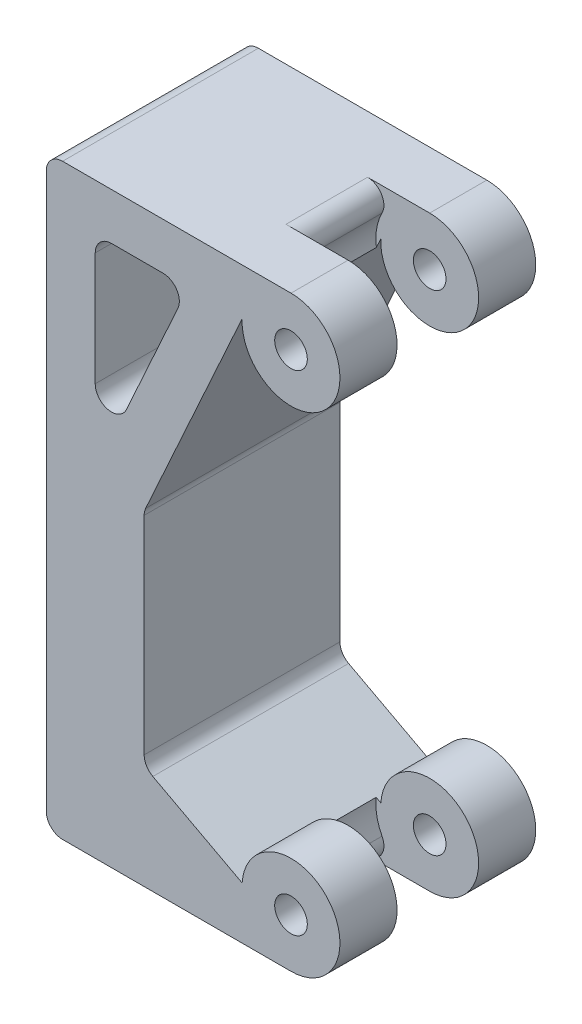
ISO-10303-21;
HEADER;
FILE_DESCRIPTION(('STEP AP214'),'2;1');
FILE_NAME('part.step','',(''),(''),'','','');
FILE_SCHEMA(('AUTOMOTIVE_DESIGN { 1 0 10303 214 1 1 1 1 }'));
ENDSEC;
DATA;
#1=APPLICATION_CONTEXT('core data for automotive mechanical design processes');
#2=APPLICATION_PROTOCOL_DEFINITION('international standard','automotive_design',2000,#1);
#3=PRODUCT_CONTEXT('',#1,'mechanical');
#4=PRODUCT('Part','Part','',(#3));
#5=PRODUCT_RELATED_PRODUCT_CATEGORY('part','',(#4));
#6=PRODUCT_DEFINITION_FORMATION('','',#4);
#7=PRODUCT_DEFINITION_CONTEXT('part definition',#1,'design');
#8=PRODUCT_DEFINITION('design','',#6,#7);
#9=PRODUCT_DEFINITION_SHAPE('','',#8);
#10=(LENGTH_UNIT() NAMED_UNIT(*) SI_UNIT(.MILLI.,.METRE.));
#11=(NAMED_UNIT(*) PLANE_ANGLE_UNIT() SI_UNIT($,.RADIAN.));
#12=(NAMED_UNIT(*) SI_UNIT($,.STERADIAN.) SOLID_ANGLE_UNIT());
#13=UNCERTAINTY_MEASURE_WITH_UNIT(LENGTH_MEASURE(1.E-05),#10,'distance_accuracy_value','');
#14=(GEOMETRIC_REPRESENTATION_CONTEXT(3) GLOBAL_UNCERTAINTY_ASSIGNED_CONTEXT((#13)) GLOBAL_UNIT_ASSIGNED_CONTEXT((#10,
#11,#12)) REPRESENTATION_CONTEXT('',''));
#15=CARTESIAN_POINT('',(0.,0.,0.));
#16=DIRECTION('',(0.,0.,1.));
#17=DIRECTION('',(1.,0.,0.));
#18=AXIS2_PLACEMENT_3D('',#15,#16,#17);
#19=CARTESIAN_POINT('',(15.,3.,12.));
#20=DIRECTION('',(0.,0.,-1.));
#21=DIRECTION('',(-1.,0.,0.));
#22=AXIS2_PLACEMENT_3D('',#19,#20,#21);
#23=CYLINDRICAL_SURFACE('',#22,3.);
#24=CARTESIAN_POINT('',(15.,3.,3.5));
#25=DIRECTION('',(0.,0.,1.));
#26=DIRECTION('',(1.,0.,0.));
#27=AXIS2_PLACEMENT_3D('',#24,#25,#26);
#28=CIRCLE('',#27,3.);
#29=CARTESIAN_POINT('',(15.,0.,3.5));
#30=VERTEX_POINT('',#29);
#31=CARTESIAN_POINT('',(12.0063708285754,3.19540824955942,3.5));
#32=VERTEX_POINT('',#31);
#33=EDGE_CURVE('E224',#30,#32,#28,.T.);
#34=ORIENTED_EDGE('',*,*,#33,.F.);
#35=DIRECTION('',(0.,0.,-1.));
#36=VECTOR('',#35,1.);
#37=CARTESIAN_POINT('',(15.,0.,12.));
#38=LINE('',#37,#36);
#39=CARTESIAN_POINT('',(15.,0.,0.));
#40=VERTEX_POINT('',#39);
#41=EDGE_CURVE('E252',#30,#40,#38,.T.);
#42=ORIENTED_EDGE('',*,*,#41,.T.);
#43=CARTESIAN_POINT('',(15.,3.,0.));
#44=DIRECTION('',(0.,0.,1.));
#45=DIRECTION('',(1.,0.,0.));
#46=AXIS2_PLACEMENT_3D('',#43,#44,#45);
#47=CIRCLE('',#46,3.);
#48=CARTESIAN_POINT('',(12.0063708285754,3.19540824955942,0.));
#49=VERTEX_POINT('',#48);
#50=EDGE_CURVE('E389',#40,#49,#47,.T.);
#51=ORIENTED_EDGE('',*,*,#50,.T.);
#52=DIRECTION('',(0.,0.,-1.));
#53=VECTOR('',#52,1.);
#54=CARTESIAN_POINT('',(12.0063708285754,3.19540824955942,12.));
#55=LINE('',#54,#53);
#56=EDGE_CURVE('E411',#32,#49,#55,.T.);
#57=ORIENTED_EDGE('',*,*,#56,.F.);
#58=EDGE_LOOP('',(#34,#42,#51,#57));
#59=FACE_BOUND('',#58,.T.);
#60=ADVANCED_FACE('F33',(#59),#23,.T.);
#61=CARTESIAN_POINT('',(15.,33.,12.));
#62=DIRECTION('',(0.,0.,-1.));
#63=DIRECTION('',(-1.,0.,0.));
#64=AXIS2_PLACEMENT_3D('',#61,#62,#63);
#65=CYLINDRICAL_SURFACE('',#64,3.);
#66=CARTESIAN_POINT('',(15.,33.,3.5));
#67=DIRECTION('',(0.,0.,1.));
#68=DIRECTION('',(1.,0.,0.));
#69=AXIS2_PLACEMENT_3D('',#66,#67,#68);
#70=CIRCLE('',#69,3.);
#71=CARTESIAN_POINT('',(12.003141676768,33.1372595733469,3.5));
#72=VERTEX_POINT('',#71);
#73=CARTESIAN_POINT('',(15.,36.,3.5));
#74=VERTEX_POINT('',#73);
#75=EDGE_CURVE('E426',#72,#74,#70,.T.);
#76=ORIENTED_EDGE('',*,*,#75,.F.);
#77=DIRECTION('',(0.,0.,-1.));
#78=VECTOR('',#77,1.);
#79=CARTESIAN_POINT('',(12.003141676768,33.1372595733469,12.));
#80=LINE('',#79,#78);
#81=CARTESIAN_POINT('',(12.003141676768,33.1372595733469,0.));
#82=VERTEX_POINT('',#81);
#83=EDGE_CURVE('E407',#72,#82,#80,.T.);
#84=ORIENTED_EDGE('',*,*,#83,.T.);
#85=CARTESIAN_POINT('',(15.,33.,0.));
#86=DIRECTION('',(0.,0.,1.));
#87=DIRECTION('',(-1.,0.,0.));
#88=AXIS2_PLACEMENT_3D('',#85,#86,#87);
#89=CIRCLE('',#88,3.);
#90=CARTESIAN_POINT('',(15.,36.,0.));
#91=VERTEX_POINT('',#90);
#92=EDGE_CURVE('E399',#82,#91,#89,.T.);
#93=ORIENTED_EDGE('',*,*,#92,.T.);
#94=DIRECTION('',(0.,0.,-1.));
#95=VECTOR('',#94,1.);
#96=CARTESIAN_POINT('',(15.,36.,12.));
#97=LINE('',#96,#95);
#98=EDGE_CURVE('E384',#74,#91,#97,.T.);
#99=ORIENTED_EDGE('',*,*,#98,.F.);
#100=EDGE_LOOP('',(#76,#84,#93,#99));
#101=FACE_BOUND('',#100,.T.);
#102=ADVANCED_FACE('F467',(#101),#65,.T.);
#103=CARTESIAN_POINT('',(15.,33.,12.));
#104=DIRECTION('',(0.,0.,-1.));
#105=DIRECTION('',(-1.,0.,0.));
#106=AXIS2_PLACEMENT_3D('',#103,#104,#105);
#107=CYLINDRICAL_SURFACE('',#106,1.);
#108=CARTESIAN_POINT('',(15.,33.,0.));
#109=DIRECTION('',(0.,0.,1.));
#110=DIRECTION('',(1.,0.,0.));
#111=AXIS2_PLACEMENT_3D('',#108,#109,#110);
#112=CIRCLE('',#111,1.);
#113=CARTESIAN_POINT('',(16.,33.,0.));
#114=VERTEX_POINT('',#113);
#115=EDGE_CURVE('E455',#114,#114,#112,.T.);
#116=ORIENTED_EDGE('',*,*,#115,.F.);
#117=EDGE_LOOP('',(#116));
#118=FACE_BOUND('',#117,.T.);
#119=CARTESIAN_POINT('',(15.,33.,3.5));
#120=DIRECTION('',(0.,0.,1.));
#121=DIRECTION('',(1.,0.,0.));
#122=AXIS2_PLACEMENT_3D('',#119,#120,#121);
#123=CIRCLE('',#122,1.);
#124=CARTESIAN_POINT('',(16.,33.,3.5));
#125=VERTEX_POINT('',#124);
#126=EDGE_CURVE('E420',#125,#125,#123,.T.);
#127=ORIENTED_EDGE('',*,*,#126,.T.);
#128=EDGE_LOOP('',(#127));
#129=FACE_BOUND('',#128,.T.);
#130=ADVANCED_FACE('F464',(#118,#129),#107,.F.);
#131=CARTESIAN_POINT('',(15.,3.,12.));
#132=DIRECTION('',(0.,0.,-1.));
#133=DIRECTION('',(-1.,0.,0.));
#134=AXIS2_PLACEMENT_3D('',#131,#132,#133);
#135=CYLINDRICAL_SURFACE('',#134,0.999999999999998);
#136=CARTESIAN_POINT('',(15.,3.,0.));
#137=DIRECTION('',(0.,0.,1.));
#138=DIRECTION('',(1.,0.,0.));
#139=AXIS2_PLACEMENT_3D('',#136,#137,#138);
#140=CIRCLE('',#139,0.999999999999998);
#141=CARTESIAN_POINT('',(16.,3.,0.));
#142=VERTEX_POINT('',#141);
#143=EDGE_CURVE('E451',#142,#142,#140,.T.);
#144=ORIENTED_EDGE('',*,*,#143,.F.);
#145=EDGE_LOOP('',(#144));
#146=FACE_BOUND('',#145,.T.);
#147=CARTESIAN_POINT('',(15.,3.,3.5));
#148=DIRECTION('',(0.,0.,1.));
#149=DIRECTION('',(1.,0.,0.));
#150=AXIS2_PLACEMENT_3D('',#147,#148,#149);
#151=CIRCLE('',#150,0.999999999999998);
#152=CARTESIAN_POINT('',(16.,3.,3.5));
#153=VERTEX_POINT('',#152);
#154=EDGE_CURVE('E228',#153,#153,#151,.T.);
#155=ORIENTED_EDGE('',*,*,#154,.T.);
#156=EDGE_LOOP('',(#155));
#157=FACE_BOUND('',#156,.T.);
#158=ADVANCED_FACE('F466',(#146,#157),#135,.F.);
#159=CARTESIAN_POINT('',(15.,33.,12.));
#160=DIRECTION('',(0.,0.,-1.));
#161=DIRECTION('',(-1.,0.,0.));
#162=AXIS2_PLACEMENT_3D('',#159,#160,#161);
#163=PLANE('',#162);
#164=DIRECTION('',(0.,-1.,0.));
#165=VECTOR('',#164,1.);
#166=CARTESIAN_POINT('',(0.,0.,12.));
#167=LINE('',#166,#165);
#168=CARTESIAN_POINT('',(0.,35.,12.));
#169=VERTEX_POINT('',#168);
#170=CARTESIAN_POINT('',(0.,1.,12.));
#171=VERTEX_POINT('',#170);
#172=EDGE_CURVE('E363',#169,#171,#167,.T.);
#173=ORIENTED_EDGE('',*,*,#172,.T.);
#174=CARTESIAN_POINT('',(1.,1.,12.));
#175=DIRECTION('',(0.,0.,-1.));
#176=DIRECTION('',(-1.,0.,0.));
#177=AXIS2_PLACEMENT_3D('',#174,#175,#176);
#178=CIRCLE('',#177,1.);
#179=CARTESIAN_POINT('',(1.,0.,12.));
#180=VERTEX_POINT('',#179);
#181=EDGE_CURVE('E268',#171,#180,#178,.F.);
#182=ORIENTED_EDGE('',*,*,#181,.T.);
#183=DIRECTION('',(1.,0.,0.));
#184=VECTOR('',#183,1.);
#185=CARTESIAN_POINT('',(0.,0.,12.));
#186=LINE('',#185,#184);
#187=CARTESIAN_POINT('',(15.,0.,12.));
#188=VERTEX_POINT('',#187);
#189=EDGE_CURVE('E366',#180,#188,#186,.T.);
#190=ORIENTED_EDGE('',*,*,#189,.T.);
#191=CARTESIAN_POINT('',(15.,3.,12.));
#192=DIRECTION('',(0.,0.,1.));
#193=DIRECTION('',(1.,0.,0.));
#194=AXIS2_PLACEMENT_3D('',#191,#192,#193);
#195=CIRCLE('',#194,3.);
#196=CARTESIAN_POINT('',(12.0063708285754,3.19540824955942,12.));
#197=VERTEX_POINT('',#196);
#198=EDGE_CURVE('E369',#188,#197,#195,.T.);
#199=ORIENTED_EDGE('',*,*,#198,.T.);
#200=DIRECTION('',(-0.882789387561308,0.46976898280871,0.));
#201=VECTOR('',#200,1.);
#202=CARTESIAN_POINT('',(6.,6.39164820698169,12.));
#203=LINE('',#202,#201);
#204=CARTESIAN_POINT('',(6.53023101719129,6.10949020971841,12.));
#205=VERTEX_POINT('',#204);
#206=EDGE_CURVE('E371',#197,#205,#203,.T.);
#207=ORIENTED_EDGE('',*,*,#206,.T.);
#208=CARTESIAN_POINT('',(7.,6.99227959727972,12.));
#209=DIRECTION('',(0.,0.,-1.));
#210=DIRECTION('',(-1.,0.,0.));
#211=AXIS2_PLACEMENT_3D('',#208,#209,#210);
#212=CIRCLE('',#211,1.);
#213=CARTESIAN_POINT('',(6.,6.99227959727972,12.));
#214=VERTEX_POINT('',#213);
#215=EDGE_CURVE('E284',#205,#214,#212,.T.);
#216=ORIENTED_EDGE('',*,*,#215,.T.);
#217=DIRECTION('',(0.,1.,0.));
#218=VECTOR('',#217,1.);
#219=CARTESIAN_POINT('',(6.,19.9205851396647,12.));
#220=LINE('',#219,#218);
#221=CARTESIAN_POINT('',(6.,19.7041216198449,12.));
#222=VERTEX_POINT('',#221);
#223=EDGE_CURVE('E374',#214,#222,#220,.T.);
#224=ORIENTED_EDGE('',*,*,#223,.T.);
#225=CARTESIAN_POINT('',(7.,19.7041216198449,12.));
#226=DIRECTION('',(0.,0.,-1.));
#227=DIRECTION('',(-1.,0.,0.));
#228=AXIS2_PLACEMENT_3D('',#225,#226,#227);
#229=CIRCLE('',#228,1.);
#230=CARTESIAN_POINT('',(6.0895183960905,20.1176711923781,12.));
#231=VERTEX_POINT('',#230);
#232=EDGE_CURVE('E288',#222,#231,#229,.T.);
#233=ORIENTED_EDGE('',*,*,#232,.T.);
#234=DIRECTION('',(0.413549572533198,0.910481603909497,0.));
#235=VECTOR('',#234,1.);
#236=CARTESIAN_POINT('',(12.003141676768,33.1372595733469,12.));
#237=LINE('',#236,#235);
#238=CARTESIAN_POINT('',(12.003141676768,33.1372595733469,12.));
#239=VERTEX_POINT('',#238);
#240=EDGE_CURVE('E377',#231,#239,#237,.T.);
#241=ORIENTED_EDGE('',*,*,#240,.T.);
#242=CARTESIAN_POINT('',(15.,33.,12.));
#243=DIRECTION('',(0.,0.,1.));
#244=DIRECTION('',(-1.,0.,0.));
#245=AXIS2_PLACEMENT_3D('',#242,#243,#244);
#246=CIRCLE('',#245,3.);
#247=CARTESIAN_POINT('',(15.,36.,12.));
#248=VERTEX_POINT('',#247);
#249=EDGE_CURVE('E379',#239,#248,#246,.T.);
#250=ORIENTED_EDGE('',*,*,#249,.T.);
#251=DIRECTION('',(-1.,0.,0.));
#252=VECTOR('',#251,1.);
#253=CARTESIAN_POINT('',(0.,36.,12.));
#254=LINE('',#253,#252);
#255=CARTESIAN_POINT('',(0.999999999999999,36.,12.));
#256=VERTEX_POINT('',#255);
#257=EDGE_CURVE('E381',#248,#256,#254,.T.);
#258=ORIENTED_EDGE('',*,*,#257,.T.);
#259=CARTESIAN_POINT('',(1.,35.,12.));
#260=DIRECTION('',(0.,0.,-1.));
#261=DIRECTION('',(-1.,0.,0.));
#262=AXIS2_PLACEMENT_3D('',#259,#260,#261);
#263=CIRCLE('',#262,1.);
#264=EDGE_CURVE('E266',#256,#169,#263,.F.);
#265=ORIENTED_EDGE('',*,*,#264,.T.);
#266=EDGE_LOOP('',(#173,#182,#190,#199,#207,#216,#224,#233,#241,#250,#258,#265));
#267=FACE_BOUND('',#266,.T.);
#268=DIRECTION('',(0.413549572533198,0.910481603909497,0.));
#269=VECTOR('',#268,1.);
#270=CARTESIAN_POINT('',(3.,20.5699756991241,12.));
#271=LINE('',#270,#269);
#272=CARTESIAN_POINT('',(4.9104816039095,24.7761421916005,12.));
#273=VERTEX_POINT('',#272);
#274=CARTESIAN_POINT('',(8.06613426653167,31.7237100008137,12.));
#275=VERTEX_POINT('',#274);
#276=EDGE_CURVE('E345',#273,#275,#271,.T.);
#277=ORIENTED_EDGE('',*,*,#276,.F.);
#278=CARTESIAN_POINT('',(4.,25.1896917641337,12.));
#279=DIRECTION('',(0.,0.,-1.));
#280=DIRECTION('',(-1.,0.,0.));
#281=AXIS2_PLACEMENT_3D('',#278,#279,#280);
#282=CIRCLE('',#281,1.);
#283=CARTESIAN_POINT('',(3.,25.1896917641337,12.));
#284=VERTEX_POINT('',#283);
#285=EDGE_CURVE('E325',#273,#284,#282,.T.);
#286=ORIENTED_EDGE('',*,*,#285,.T.);
#287=DIRECTION('',(0.,-1.,0.));
#288=VECTOR('',#287,1.);
#289=CARTESIAN_POINT('',(3.,33.1372595733469,12.));
#290=LINE('',#289,#288);
#291=CARTESIAN_POINT('',(3.,32.1372595733469,12.));
#292=VERTEX_POINT('',#291);
#293=EDGE_CURVE('E350',#292,#284,#290,.T.);
#294=ORIENTED_EDGE('',*,*,#293,.F.);
#295=CARTESIAN_POINT('',(4.,32.1372595733469,12.));
#296=DIRECTION('',(0.,0.,-1.));
#297=DIRECTION('',(-1.,0.,0.));
#298=AXIS2_PLACEMENT_3D('',#295,#296,#297);
#299=CIRCLE('',#298,1.);
#300=CARTESIAN_POINT('',(4.,33.1372595733469,12.));
#301=VERTEX_POINT('',#300);
#302=EDGE_CURVE('E11',#292,#301,#299,.T.);
#303=ORIENTED_EDGE('',*,*,#302,.T.);
#304=DIRECTION('',(-1.,0.,0.));
#305=VECTOR('',#304,1.);
#306=CARTESIAN_POINT('',(8.70818218816513,33.1372595733469,12.));
#307=LINE('',#306,#305);
#308=CARTESIAN_POINT('',(7.15565266262217,33.1372595733469,12.));
#309=VERTEX_POINT('',#308);
#310=EDGE_CURVE('E348',#309,#301,#307,.T.);
#311=ORIENTED_EDGE('',*,*,#310,.F.);
#312=CARTESIAN_POINT('',(7.15565266262217,32.1372595733469,12.));
#313=DIRECTION('',(0.,0.,-1.));
#314=DIRECTION('',(-1.,0.,0.));
#315=AXIS2_PLACEMENT_3D('',#312,#313,#314);
#316=CIRCLE('',#315,1.);
#317=EDGE_CURVE('E329',#309,#275,#316,.T.);
#318=ORIENTED_EDGE('',*,*,#317,.T.);
#319=EDGE_LOOP('',(#277,#286,#294,#303,#311,#318));
#320=FACE_BOUND('',#319,.T.);
#321=CARTESIAN_POINT('',(15.,33.,12.));
#322=DIRECTION('',(0.,0.,1.));
#323=DIRECTION('',(1.,0.,0.));
#324=AXIS2_PLACEMENT_3D('',#321,#322,#323);
#325=CIRCLE('',#324,1.);
#326=CARTESIAN_POINT('',(16.,33.,12.));
#327=VERTEX_POINT('',#326);
#328=EDGE_CURVE('E361',#327,#327,#325,.T.);
#329=ORIENTED_EDGE('',*,*,#328,.F.);
#330=EDGE_LOOP('',(#329));
#331=FACE_BOUND('',#330,.T.);
#332=CARTESIAN_POINT('',(15.,3.,12.));
#333=DIRECTION('',(0.,0.,1.));
#334=DIRECTION('',(1.,0.,0.));
#335=AXIS2_PLACEMENT_3D('',#332,#333,#334);
#336=CIRCLE('',#335,0.999999999999998);
#337=CARTESIAN_POINT('',(16.,3.,12.));
#338=VERTEX_POINT('',#337);
#339=EDGE_CURVE('E452',#338,#338,#336,.T.);
#340=ORIENTED_EDGE('',*,*,#339,.F.);
#341=EDGE_LOOP('',(#340));
#342=FACE_BOUND('',#341,.T.);
#343=ADVANCED_FACE('F474',(#267,#320,#331,#342),#163,.F.);
#344=CARTESIAN_POINT('',(15.,33.,0.));
#345=DIRECTION('',(0.,0.,-1.));
#346=DIRECTION('',(-1.,0.,0.));
#347=AXIS2_PLACEMENT_3D('',#344,#345,#346);
#348=PLANE('',#347);
#349=ORIENTED_EDGE('',*,*,#115,.T.);
#350=EDGE_LOOP('',(#349));
#351=FACE_BOUND('',#350,.T.);
#352=DIRECTION('',(1.,0.,0.));
#353=VECTOR('',#352,1.);
#354=CARTESIAN_POINT('',(0.,0.,0.));
#355=LINE('',#354,#353);
#356=CARTESIAN_POINT('',(1.,0.,0.));
#357=VERTEX_POINT('',#356);
#358=EDGE_CURVE('E387',#357,#40,#355,.T.);
#359=ORIENTED_EDGE('',*,*,#358,.F.);
#360=CARTESIAN_POINT('',(1.,1.,0.));
#361=DIRECTION('',(0.,0.,-1.));
#362=DIRECTION('',(-1.,0.,0.));
#363=AXIS2_PLACEMENT_3D('',#360,#361,#362);
#364=CIRCLE('',#363,1.);
#365=CARTESIAN_POINT('',(0.,1.,0.));
#366=VERTEX_POINT('',#365);
#367=EDGE_CURVE('E259',#357,#366,#364,.T.);
#368=ORIENTED_EDGE('',*,*,#367,.T.);
#369=DIRECTION('',(0.,-1.,0.));
#370=VECTOR('',#369,1.);
#371=CARTESIAN_POINT('',(0.,0.,0.));
#372=LINE('',#371,#370);
#373=CARTESIAN_POINT('',(0.,35.,0.));
#374=VERTEX_POINT('',#373);
#375=EDGE_CURVE('E352',#374,#366,#372,.T.);
#376=ORIENTED_EDGE('',*,*,#375,.F.);
#377=CARTESIAN_POINT('',(1.,35.,0.));
#378=DIRECTION('',(0.,0.,-1.));
#379=DIRECTION('',(-1.,0.,0.));
#380=AXIS2_PLACEMENT_3D('',#377,#378,#379);
#381=CIRCLE('',#380,1.);
#382=CARTESIAN_POINT('',(0.999999999999999,36.,0.));
#383=VERTEX_POINT('',#382);
#384=EDGE_CURVE('E249',#374,#383,#381,.T.);
#385=ORIENTED_EDGE('',*,*,#384,.T.);
#386=DIRECTION('',(-1.,0.,0.));
#387=VECTOR('',#386,1.);
#388=CARTESIAN_POINT('',(0.,36.,0.));
#389=LINE('',#388,#387);
#390=EDGE_CURVE('E367',#91,#383,#389,.T.);
#391=ORIENTED_EDGE('',*,*,#390,.F.);
#392=ORIENTED_EDGE('',*,*,#92,.F.);
#393=DIRECTION('',(0.413549572533198,0.910481603909497,0.));
#394=VECTOR('',#393,1.);
#395=CARTESIAN_POINT('',(12.003141676768,33.1372595733469,0.));
#396=LINE('',#395,#394);
#397=CARTESIAN_POINT('',(6.0895183960905,20.1176711923781,0.));
#398=VERTEX_POINT('',#397);
#399=EDGE_CURVE('E397',#398,#82,#396,.T.);
#400=ORIENTED_EDGE('',*,*,#399,.F.);
#401=CARTESIAN_POINT('',(7.,19.7041216198449,0.));
#402=DIRECTION('',(0.,0.,-1.));
#403=DIRECTION('',(-1.,0.,0.));
#404=AXIS2_PLACEMENT_3D('',#401,#402,#403);
#405=CIRCLE('',#404,1.);
#406=CARTESIAN_POINT('',(6.,19.7041216198449,0.));
#407=VERTEX_POINT('',#406);
#408=EDGE_CURVE('E286',#398,#407,#405,.F.);
#409=ORIENTED_EDGE('',*,*,#408,.T.);
#410=DIRECTION('',(0.,1.,0.));
#411=VECTOR('',#410,1.);
#412=CARTESIAN_POINT('',(6.,19.9205851396647,0.));
#413=LINE('',#412,#411);
#414=CARTESIAN_POINT('',(6.,6.99227959727972,0.));
#415=VERTEX_POINT('',#414);
#416=EDGE_CURVE('E394',#415,#407,#413,.T.);
#417=ORIENTED_EDGE('',*,*,#416,.F.);
#418=CARTESIAN_POINT('',(7.,6.99227959727972,0.));
#419=DIRECTION('',(0.,0.,-1.));
#420=DIRECTION('',(-1.,0.,0.));
#421=AXIS2_PLACEMENT_3D('',#418,#419,#420);
#422=CIRCLE('',#421,1.);
#423=CARTESIAN_POINT('',(6.53023101719129,6.10949020971841,0.));
#424=VERTEX_POINT('',#423);
#425=EDGE_CURVE('E282',#415,#424,#422,.F.);
#426=ORIENTED_EDGE('',*,*,#425,.T.);
#427=DIRECTION('',(-0.882789387561308,0.46976898280871,0.));
#428=VECTOR('',#427,1.);
#429=CARTESIAN_POINT('',(6.,6.39164820698169,0.));
#430=LINE('',#429,#428);
#431=EDGE_CURVE('E392',#49,#424,#430,.T.);
#432=ORIENTED_EDGE('',*,*,#431,.F.);
#433=ORIENTED_EDGE('',*,*,#50,.F.);
#434=EDGE_LOOP('',(#359,#368,#376,#385,#391,#392,#400,#409,#417,#426,#432,#433));
#435=FACE_BOUND('',#434,.T.);
#436=DIRECTION('',(-1.,0.,0.));
#437=VECTOR('',#436,1.);
#438=CARTESIAN_POINT('',(8.70818218816513,33.1372595733469,0.));
#439=LINE('',#438,#437);
#440=CARTESIAN_POINT('',(7.15565266262217,33.1372595733469,0.));
#441=VERTEX_POINT('',#440);
#442=CARTESIAN_POINT('',(4.,33.1372595733469,0.));
#443=VERTEX_POINT('',#442);
#444=EDGE_CURVE('E337',#441,#443,#439,.T.);
#445=ORIENTED_EDGE('',*,*,#444,.T.);
#446=CARTESIAN_POINT('',(4.,32.1372595733469,0.));
#447=DIRECTION('',(0.,0.,-1.));
#448=DIRECTION('',(-1.,0.,0.));
#449=AXIS2_PLACEMENT_3D('',#446,#447,#448);
#450=CIRCLE('',#449,1.);
#451=CARTESIAN_POINT('',(3.,32.1372595733469,0.));
#452=VERTEX_POINT('',#451);
#453=EDGE_CURVE('E41',#443,#452,#450,.F.);
#454=ORIENTED_EDGE('',*,*,#453,.T.);
#455=DIRECTION('',(0.,-1.,0.));
#456=VECTOR('',#455,1.);
#457=CARTESIAN_POINT('',(3.,33.1372595733469,0.));
#458=LINE('',#457,#456);
#459=CARTESIAN_POINT('',(3.,25.1896917641337,0.));
#460=VERTEX_POINT('',#459);
#461=EDGE_CURVE('E336',#452,#460,#458,.T.);
#462=ORIENTED_EDGE('',*,*,#461,.T.);
#463=CARTESIAN_POINT('',(4.,25.1896917641337,0.));
#464=DIRECTION('',(0.,0.,-1.));
#465=DIRECTION('',(-1.,0.,0.));
#466=AXIS2_PLACEMENT_3D('',#463,#464,#465);
#467=CIRCLE('',#466,1.);
#468=CARTESIAN_POINT('',(4.9104816039095,24.7761421916005,0.));
#469=VERTEX_POINT('',#468);
#470=EDGE_CURVE('E323',#460,#469,#467,.F.);
#471=ORIENTED_EDGE('',*,*,#470,.T.);
#472=DIRECTION('',(0.413549572533198,0.910481603909497,0.));
#473=VECTOR('',#472,1.);
#474=CARTESIAN_POINT('',(3.,20.5699756991241,0.));
#475=LINE('',#474,#473);
#476=CARTESIAN_POINT('',(8.06613426653167,31.7237100008137,0.));
#477=VERTEX_POINT('',#476);
#478=EDGE_CURVE('E358',#469,#477,#475,.T.);
#479=ORIENTED_EDGE('',*,*,#478,.T.);
#480=CARTESIAN_POINT('',(7.15565266262217,32.1372595733469,0.));
#481=DIRECTION('',(0.,0.,-1.));
#482=DIRECTION('',(-1.,0.,0.));
#483=AXIS2_PLACEMENT_3D('',#480,#481,#482);
#484=CIRCLE('',#483,1.);
#485=EDGE_CURVE('E327',#477,#441,#484,.F.);
#486=ORIENTED_EDGE('',*,*,#485,.T.);
#487=EDGE_LOOP('',(#445,#454,#462,#471,#479,#486));
#488=FACE_BOUND('',#487,.T.);
#489=ORIENTED_EDGE('',*,*,#143,.T.);
#490=EDGE_LOOP('',(#489));
#491=FACE_BOUND('',#490,.T.);
#492=ADVANCED_FACE('F334',(#351,#435,#488,#491),#348,.T.);
#493=CARTESIAN_POINT('',(0.,0.,12.));
#494=DIRECTION('',(1.,0.,0.));
#495=DIRECTION('',(0.,0.,-1.));
#496=AXIS2_PLACEMENT_3D('',#493,#494,#495);
#497=PLANE('',#496);
#498=ORIENTED_EDGE('',*,*,#375,.T.);
#499=DIRECTION('',(0.,0.,-1.));
#500=VECTOR('',#499,1.);
#501=CARTESIAN_POINT('',(0.,1.,12.));
#502=LINE('',#501,#500);
#503=EDGE_CURVE('E264',#366,#171,#502,.F.);
#504=ORIENTED_EDGE('',*,*,#503,.T.);
#505=ORIENTED_EDGE('',*,*,#172,.F.);
#506=DIRECTION('',(0.,0.,-1.));
#507=VECTOR('',#506,1.);
#508=CARTESIAN_POINT('',(0.,35.,12.));
#509=LINE('',#508,#507);
#510=EDGE_CURVE('E261',#169,#374,#509,.T.);
#511=ORIENTED_EDGE('',*,*,#510,.T.);
#512=EDGE_LOOP('',(#498,#504,#505,#511));
#513=FACE_BOUND('',#512,.T.);
#514=ADVANCED_FACE('F500',(#513),#497,.F.);
#515=CARTESIAN_POINT('',(0.,0.,12.));
#516=DIRECTION('',(0.,1.,0.));
#517=DIRECTION('',(0.,0.,1.));
#518=AXIS2_PLACEMENT_3D('',#515,#516,#517);
#519=PLANE('',#518);
#520=DIRECTION('',(1.,0.,0.));
#521=VECTOR('',#520,1.);
#522=CARTESIAN_POINT('',(0.,0.,3.5));
#523=LINE('',#522,#521);
#524=CARTESIAN_POINT('',(11.1934267378651,0.,3.5));
#525=VERTEX_POINT('',#524);
#526=EDGE_CURVE('E419',#525,#30,#523,.T.);
#527=ORIENTED_EDGE('',*,*,#526,.F.);
#528=DIRECTION('',(0.,0.,1.));
#529=VECTOR('',#528,1.);
#530=CARTESIAN_POINT('',(11.1934267378651,0.,8.5));
#531=LINE('',#530,#529);
#532=CARTESIAN_POINT('',(11.1934267378651,0.,8.5));
#533=VERTEX_POINT('',#532);
#534=EDGE_CURVE('E297',#525,#533,#531,.T.);
#535=ORIENTED_EDGE('',*,*,#534,.T.);
#536=DIRECTION('',(1.,0.,0.));
#537=VECTOR('',#536,1.);
#538=CARTESIAN_POINT('',(0.,0.,8.5));
#539=LINE('',#538,#537);
#540=CARTESIAN_POINT('',(15.,0.,8.5));
#541=VERTEX_POINT('',#540);
#542=EDGE_CURVE('E423',#533,#541,#539,.T.);
#543=ORIENTED_EDGE('',*,*,#542,.T.);
#544=EDGE_CURVE('E246',#188,#541,#38,.T.);
#545=ORIENTED_EDGE('',*,*,#544,.F.);
#546=ORIENTED_EDGE('',*,*,#189,.F.);
#547=DIRECTION('',(0.,0.,-1.));
#548=VECTOR('',#547,1.);
#549=CARTESIAN_POINT('',(1.,0.,12.));
#550=LINE('',#549,#548);
#551=EDGE_CURVE('E245',#180,#357,#550,.T.);
#552=ORIENTED_EDGE('',*,*,#551,.T.);
#553=ORIENTED_EDGE('',*,*,#358,.T.);
#554=ORIENTED_EDGE('',*,*,#41,.F.);
#555=EDGE_LOOP('',(#527,#535,#543,#545,#546,#552,#553,#554));
#556=FACE_BOUND('',#555,.T.);
#557=ADVANCED_FACE('F493',(#556),#519,.F.);
#558=ORIENTED_EDGE('',*,*,#544,.T.);
#559=CARTESIAN_POINT('',(15.,3.,8.5));
#560=DIRECTION('',(0.,0.,1.));
#561=DIRECTION('',(1.,0.,0.));
#562=AXIS2_PLACEMENT_3D('',#559,#560,#561);
#563=CIRCLE('',#562,3.);
#564=CARTESIAN_POINT('',(12.0063708285754,3.19540824955942,8.5));
#565=VERTEX_POINT('',#564);
#566=EDGE_CURVE('E429',#541,#565,#563,.T.);
#567=ORIENTED_EDGE('',*,*,#566,.T.);
#568=EDGE_CURVE('E412',#197,#565,#55,.T.);
#569=ORIENTED_EDGE('',*,*,#568,.F.);
#570=ORIENTED_EDGE('',*,*,#198,.F.);
#571=EDGE_LOOP('',(#558,#567,#569,#570));
#572=FACE_BOUND('',#571,.T.);
#573=ADVANCED_FACE('F487',(#572),#23,.T.);
#574=CARTESIAN_POINT('',(6.,6.39164820698169,12.));
#575=DIRECTION('',(-0.46976898280871,-0.882789387561308,0.));
#576=DIRECTION('',(0.882789387561309,-0.46976898280871,0.));
#577=AXIS2_PLACEMENT_3D('',#574,#575,#576);
#578=PLANE('',#577);
#579=ORIENTED_EDGE('',*,*,#431,.T.);
#580=DIRECTION('',(0.,0.,-1.));
#581=VECTOR('',#580,1.);
#582=CARTESIAN_POINT('',(6.53023101719129,6.10949020971841,12.));
#583=LINE('',#582,#581);
#584=EDGE_CURVE('E277',#424,#205,#583,.F.);
#585=ORIENTED_EDGE('',*,*,#584,.T.);
#586=ORIENTED_EDGE('',*,*,#206,.F.);
#587=ORIENTED_EDGE('',*,*,#568,.T.);
#588=DIRECTION('',(-0.882789387561309,0.46976898280871,0.));
#589=VECTOR('',#588,1.);
#590=CARTESIAN_POINT('',(6.,6.39164820698169,8.5));
#591=LINE('',#590,#589);
#592=CARTESIAN_POINT('',(11.7184656234396,3.34861459443363,8.5));
#593=VERTEX_POINT('',#592);
#594=EDGE_CURVE('E244',#565,#593,#591,.T.);
#595=ORIENTED_EDGE('',*,*,#594,.T.);
#596=DIRECTION('',(0.,0.,-1.));
#597=VECTOR('',#596,1.);
#598=CARTESIAN_POINT('',(11.7184656234396,3.34861459443363,8.5));
#599=LINE('',#598,#597);
#600=CARTESIAN_POINT('',(11.7184656234396,3.34861459443363,3.5));
#601=VERTEX_POINT('',#600);
#602=EDGE_CURVE('E234',#601,#593,#599,.F.);
#603=ORIENTED_EDGE('',*,*,#602,.F.);
#604=DIRECTION('',(-0.882789387561309,0.46976898280871,0.));
#605=VECTOR('',#604,1.);
#606=CARTESIAN_POINT('',(6.,6.39164820698169,3.5));
#607=LINE('',#606,#605);
#608=EDGE_CURVE('E218',#32,#601,#607,.T.);
#609=ORIENTED_EDGE('',*,*,#608,.F.);
#610=ORIENTED_EDGE('',*,*,#56,.T.);
#611=EDGE_LOOP('',(#579,#585,#586,#587,#595,#603,#609,#610));
#612=FACE_BOUND('',#611,.T.);
#613=ADVANCED_FACE('F242',(#612),#578,.F.);
#614=CARTESIAN_POINT('',(6.,19.9205851396647,12.));
#615=DIRECTION('',(-1.,0.,0.));
#616=DIRECTION('',(0.,-1.,0.));
#617=AXIS2_PLACEMENT_3D('',#614,#615,#616);
#618=PLANE('',#617);
#619=ORIENTED_EDGE('',*,*,#223,.F.);
#620=DIRECTION('',(0.,0.,-1.));
#621=VECTOR('',#620,1.);
#622=CARTESIAN_POINT('',(6.,6.99227959727972,0.));
#623=LINE('',#622,#621);
#624=EDGE_CURVE('E274',#214,#415,#623,.T.);
#625=ORIENTED_EDGE('',*,*,#624,.T.);
#626=ORIENTED_EDGE('',*,*,#416,.T.);
#627=DIRECTION('',(0.,0.,-1.));
#628=VECTOR('',#627,1.);
#629=CARTESIAN_POINT('',(6.,19.7041216198449,12.));
#630=LINE('',#629,#628);
#631=EDGE_CURVE('E272',#407,#222,#630,.F.);
#632=ORIENTED_EDGE('',*,*,#631,.T.);
#633=EDGE_LOOP('',(#619,#625,#626,#632));
#634=FACE_BOUND('',#633,.T.);
#635=ADVANCED_FACE('F499',(#634),#618,.F.);
#636=CARTESIAN_POINT('',(12.003141676768,33.1372595733469,12.));
#637=DIRECTION('',(-0.910481603909497,0.413549572533198,0.));
#638=DIRECTION('',(-0.413549572533198,-0.910481603909497,0.));
#639=AXIS2_PLACEMENT_3D('',#636,#637,#638);
#640=PLANE('',#639);
#641=ORIENTED_EDGE('',*,*,#240,.F.);
#642=DIRECTION('',(0.,0.,-1.));
#643=VECTOR('',#642,1.);
#644=CARTESIAN_POINT('',(6.0895183960905,20.1176711923781,0.));
#645=LINE('',#644,#643);
#646=EDGE_CURVE('E279',#231,#398,#645,.T.);
#647=ORIENTED_EDGE('',*,*,#646,.T.);
#648=ORIENTED_EDGE('',*,*,#399,.T.);
#649=ORIENTED_EDGE('',*,*,#83,.F.);
#650=DIRECTION('',(0.413549572533198,0.910481603909497,0.));
#651=VECTOR('',#650,1.);
#652=CARTESIAN_POINT('',(12.003141676768,33.1372595733469,3.5));
#653=LINE('',#652,#651);
#654=CARTESIAN_POINT('',(11.7321333877923,32.5406006042469,3.5));
#655=VERTEX_POINT('',#654);
#656=EDGE_CURVE('E438',#655,#72,#653,.T.);
#657=ORIENTED_EDGE('',*,*,#656,.F.);
#658=DIRECTION('',(0.,0.,-1.));
#659=VECTOR('',#658,1.);
#660=CARTESIAN_POINT('',(11.7321333877923,32.5406006042469,8.5));
#661=LINE('',#660,#659);
#662=CARTESIAN_POINT('',(11.7321333877923,32.5406006042469,8.5));
#663=VERTEX_POINT('',#662);
#664=EDGE_CURVE('E448',#663,#655,#661,.T.);
#665=ORIENTED_EDGE('',*,*,#664,.F.);
#666=DIRECTION('',(0.413549572533198,0.910481603909497,0.));
#667=VECTOR('',#666,1.);
#668=CARTESIAN_POINT('',(12.003141676768,33.1372595733469,8.5));
#669=LINE('',#668,#667);
#670=CARTESIAN_POINT('',(12.003141676768,33.1372595733469,8.5));
#671=VERTEX_POINT('',#670);
#672=EDGE_CURVE('E445',#663,#671,#669,.T.);
#673=ORIENTED_EDGE('',*,*,#672,.T.);
#674=EDGE_CURVE('E408',#239,#671,#80,.T.);
#675=ORIENTED_EDGE('',*,*,#674,.F.);
#676=EDGE_LOOP('',(#641,#647,#648,#649,#657,#665,#673,#675));
#677=FACE_BOUND('',#676,.T.);
#678=ADVANCED_FACE('F534',(#677),#640,.F.);
#679=ORIENTED_EDGE('',*,*,#674,.T.);
#680=CARTESIAN_POINT('',(15.,33.,8.5));
#681=DIRECTION('',(0.,0.,1.));
#682=DIRECTION('',(1.,0.,0.));
#683=AXIS2_PLACEMENT_3D('',#680,#681,#682);
#684=CIRCLE('',#683,3.);
#685=CARTESIAN_POINT('',(15.,36.,8.5));
#686=VERTEX_POINT('',#685);
#687=EDGE_CURVE('E442',#671,#686,#684,.T.);
#688=ORIENTED_EDGE('',*,*,#687,.T.);
#689=EDGE_CURVE('E404',#248,#686,#97,.T.);
#690=ORIENTED_EDGE('',*,*,#689,.F.);
#691=ORIENTED_EDGE('',*,*,#249,.F.);
#692=EDGE_LOOP('',(#679,#688,#690,#691));
#693=FACE_BOUND('',#692,.T.);
#694=ADVANCED_FACE('F480',(#693),#65,.T.);
#695=CARTESIAN_POINT('',(0.,36.,12.));
#696=DIRECTION('',(0.,-1.,0.));
#697=DIRECTION('',(1.,0.,0.));
#698=AXIS2_PLACEMENT_3D('',#695,#696,#697);
#699=PLANE('',#698);
#700=DIRECTION('',(-1.,0.,0.));
#701=VECTOR('',#700,1.);
#702=CARTESIAN_POINT('',(0.,36.,8.5));
#703=LINE('',#702,#701);
#704=CARTESIAN_POINT('',(11.1934267378651,36.,8.5));
#705=VERTEX_POINT('',#704);
#706=EDGE_CURVE('E440',#686,#705,#703,.T.);
#707=ORIENTED_EDGE('',*,*,#706,.T.);
#708=DIRECTION('',(0.,0.,1.));
#709=VECTOR('',#708,1.);
#710=CARTESIAN_POINT('',(11.1934267378651,36.,3.5));
#711=LINE('',#710,#709);
#712=CARTESIAN_POINT('',(11.1934267378651,36.,3.5));
#713=VERTEX_POINT('',#712);
#714=EDGE_CURVE('E293',#705,#713,#711,.F.);
#715=ORIENTED_EDGE('',*,*,#714,.T.);
#716=DIRECTION('',(-1.,0.,0.));
#717=VECTOR('',#716,1.);
#718=CARTESIAN_POINT('',(0.,36.,3.5));
#719=LINE('',#718,#717);
#720=EDGE_CURVE('E422',#74,#713,#719,.T.);
#721=ORIENTED_EDGE('',*,*,#720,.F.);
#722=ORIENTED_EDGE('',*,*,#98,.T.);
#723=ORIENTED_EDGE('',*,*,#390,.T.);
#724=DIRECTION('',(0.,0.,-1.));
#725=VECTOR('',#724,1.);
#726=CARTESIAN_POINT('',(1.,36.,12.));
#727=LINE('',#726,#725);
#728=EDGE_CURVE('E270',#383,#256,#727,.F.);
#729=ORIENTED_EDGE('',*,*,#728,.T.);
#730=ORIENTED_EDGE('',*,*,#257,.F.);
#731=ORIENTED_EDGE('',*,*,#689,.T.);
#732=EDGE_LOOP('',(#707,#715,#721,#722,#723,#729,#730,#731));
#733=FACE_BOUND('',#732,.T.);
#734=ADVANCED_FACE('F523',(#733),#699,.F.);
#735=CARTESIAN_POINT('',(3.,20.5699756991241,12.));
#736=DIRECTION('',(-0.910481603909496,0.413549572533198,0.));
#737=DIRECTION('',(-0.413549572533198,-0.910481603909497,0.));
#738=AXIS2_PLACEMENT_3D('',#735,#736,#737);
#739=PLANE('',#738);
#740=ORIENTED_EDGE('',*,*,#478,.F.);
#741=DIRECTION('',(0.,0.,-1.));
#742=VECTOR('',#741,1.);
#743=CARTESIAN_POINT('',(4.9104816039095,24.7761421916005,12.));
#744=LINE('',#743,#742);
#745=EDGE_CURVE('E317',#469,#273,#744,.F.);
#746=ORIENTED_EDGE('',*,*,#745,.T.);
#747=ORIENTED_EDGE('',*,*,#276,.T.);
#748=DIRECTION('',(0.,0.,-1.));
#749=VECTOR('',#748,1.);
#750=CARTESIAN_POINT('',(8.06613426653167,31.7237100008137,0.));
#751=LINE('',#750,#749);
#752=EDGE_CURVE('E314',#275,#477,#751,.T.);
#753=ORIENTED_EDGE('',*,*,#752,.T.);
#754=EDGE_LOOP('',(#740,#746,#747,#753));
#755=FACE_BOUND('',#754,.T.);
#756=ADVANCED_FACE('F588',(#755),#739,.T.);
#757=CARTESIAN_POINT('',(8.70818218816513,33.1372595733469,12.));
#758=DIRECTION('',(0.,-1.,0.));
#759=DIRECTION('',(0.,0.,-1.));
#760=AXIS2_PLACEMENT_3D('',#757,#758,#759);
#761=PLANE('',#760);
#762=ORIENTED_EDGE('',*,*,#444,.F.);
#763=DIRECTION('',(0.,0.,-1.));
#764=VECTOR('',#763,1.);
#765=CARTESIAN_POINT('',(7.15565266262217,33.1372595733469,12.));
#766=LINE('',#765,#764);
#767=EDGE_CURVE('E53',#441,#309,#766,.F.);
#768=ORIENTED_EDGE('',*,*,#767,.T.);
#769=ORIENTED_EDGE('',*,*,#310,.T.);
#770=DIRECTION('',(0.,0.,-1.));
#771=VECTOR('',#770,1.);
#772=CARTESIAN_POINT('',(4.,33.1372595733469,0.));
#773=LINE('',#772,#771);
#774=EDGE_CURVE('E319',#301,#443,#773,.T.);
#775=ORIENTED_EDGE('',*,*,#774,.T.);
#776=EDGE_LOOP('',(#762,#768,#769,#775));
#777=FACE_BOUND('',#776,.T.);
#778=ADVANCED_FACE('F347',(#777),#761,.T.);
#779=CARTESIAN_POINT('',(3.,33.1372595733469,12.));
#780=DIRECTION('',(1.,0.,0.));
#781=DIRECTION('',(0.,1.,0.));
#782=AXIS2_PLACEMENT_3D('',#779,#780,#781);
#783=PLANE('',#782);
#784=ORIENTED_EDGE('',*,*,#293,.T.);
#785=DIRECTION('',(0.,0.,-1.));
#786=VECTOR('',#785,1.);
#787=CARTESIAN_POINT('',(3.,25.1896917641337,0.));
#788=LINE('',#787,#786);
#789=EDGE_CURVE('E311',#284,#460,#788,.T.);
#790=ORIENTED_EDGE('',*,*,#789,.T.);
#791=ORIENTED_EDGE('',*,*,#461,.F.);
#792=DIRECTION('',(0.,0.,-1.));
#793=VECTOR('',#792,1.);
#794=CARTESIAN_POINT('',(3.,32.1372595733469,12.));
#795=LINE('',#794,#793);
#796=EDGE_CURVE('E309',#452,#292,#795,.F.);
#797=ORIENTED_EDGE('',*,*,#796,.T.);
#798=EDGE_LOOP('',(#784,#790,#791,#797));
#799=FACE_BOUND('',#798,.T.);
#800=ADVANCED_FACE('F343',(#799),#783,.T.);
#801=CARTESIAN_POINT('',(15.,33.,8.5));
#802=DIRECTION('',(0.,0.,1.));
#803=DIRECTION('',(1.,0.,0.));
#804=AXIS2_PLACEMENT_3D('',#801,#802,#803);
#805=CIRCLE('',#804,1.);
#806=CARTESIAN_POINT('',(16.,33.,8.5));
#807=VERTEX_POINT('',#806);
#808=EDGE_CURVE('E255',#807,#807,#805,.T.);
#809=ORIENTED_EDGE('',*,*,#808,.F.);
#810=EDGE_LOOP('',(#809));
#811=FACE_BOUND('',#810,.T.);
#812=ORIENTED_EDGE('',*,*,#328,.T.);
#813=EDGE_LOOP('',(#812));
#814=FACE_BOUND('',#813,.T.);
#815=ADVANCED_FACE('F469',(#811,#814),#107,.F.);
#816=CARTESIAN_POINT('',(15.,3.,8.5));
#817=DIRECTION('',(0.,0.,1.));
#818=DIRECTION('',(1.,0.,0.));
#819=AXIS2_PLACEMENT_3D('',#816,#817,#818);
#820=CIRCLE('',#819,0.999999999999998);
#821=CARTESIAN_POINT('',(16.,3.,8.5));
#822=VERTEX_POINT('',#821);
#823=EDGE_CURVE('E417',#822,#822,#820,.T.);
#824=ORIENTED_EDGE('',*,*,#823,.F.);
#825=EDGE_LOOP('',(#824));
#826=FACE_BOUND('',#825,.T.);
#827=ORIENTED_EDGE('',*,*,#339,.T.);
#828=EDGE_LOOP('',(#827));
#829=FACE_BOUND('',#828,.T.);
#830=ADVANCED_FACE('F477',(#826,#829),#135,.F.);
#831=CARTESIAN_POINT('',(15.,3.,8.5));
#832=DIRECTION('',(0.,0.,-1.));
#833=DIRECTION('',(-1.,0.,0.));
#834=AXIS2_PLACEMENT_3D('',#831,#832,#833);
#835=CYLINDRICAL_SURFACE('',#834,3.3);
#836=CARTESIAN_POINT('',(15.,3.,8.5));
#837=DIRECTION('',(0.,0.,1.));
#838=DIRECTION('',(1.,0.,0.));
#839=AXIS2_PLACEMENT_3D('',#836,#837,#838);
#840=CIRCLE('',#839,3.3);
#841=CARTESIAN_POINT('',(12.0786763337105,1.46511627906977,8.5));
#842=VERTEX_POINT('',#841);
#843=EDGE_CURVE('E238',#593,#842,#840,.T.);
#844=ORIENTED_EDGE('',*,*,#843,.T.);
#845=DIRECTION('',(0.,0.,-1.));
#846=VECTOR('',#845,1.);
#847=CARTESIAN_POINT('',(12.0786763337105,1.46511627906977,8.5));
#848=LINE('',#847,#846);
#849=CARTESIAN_POINT('',(12.0786763337105,1.46511627906977,3.5));
#850=VERTEX_POINT('',#849);
#851=EDGE_CURVE('E237',#842,#850,#848,.T.);
#852=ORIENTED_EDGE('',*,*,#851,.T.);
#853=CARTESIAN_POINT('',(15.,3.,3.5));
#854=DIRECTION('',(0.,0.,1.));
#855=DIRECTION('',(1.,0.,0.));
#856=AXIS2_PLACEMENT_3D('',#853,#854,#855);
#857=CIRCLE('',#856,3.3);
#858=EDGE_CURVE('E222',#601,#850,#857,.T.);
#859=ORIENTED_EDGE('',*,*,#858,.F.);
#860=ORIENTED_EDGE('',*,*,#602,.T.);
#861=EDGE_LOOP('',(#844,#852,#859,#860));
#862=FACE_BOUND('',#861,.T.);
#863=ADVANCED_FACE('F233',(#862),#835,.F.);
#864=CARTESIAN_POINT('',(15.,3.,8.5));
#865=DIRECTION('',(0.,0.,1.));
#866=DIRECTION('',(1.,0.,0.));
#867=AXIS2_PLACEMENT_3D('',#864,#865,#866);
#868=PLANE('',#867);
#869=ORIENTED_EDGE('',*,*,#823,.T.);
#870=EDGE_LOOP('',(#869));
#871=FACE_BOUND('',#870,.T.);
#872=ORIENTED_EDGE('',*,*,#843,.F.);
#873=ORIENTED_EDGE('',*,*,#594,.F.);
#874=ORIENTED_EDGE('',*,*,#566,.F.);
#875=ORIENTED_EDGE('',*,*,#542,.F.);
#876=CARTESIAN_POINT('',(11.1934267378651,1.,8.5));
#877=DIRECTION('',(0.,0.,1.));
#878=DIRECTION('',(1.,0.,0.));
#879=AXIS2_PLACEMENT_3D('',#876,#877,#878);
#880=CIRCLE('',#879,1.);
#881=EDGE_CURVE('E307',#533,#842,#880,.T.);
#882=ORIENTED_EDGE('',*,*,#881,.T.);
#883=EDGE_LOOP('',(#872,#873,#874,#875,#882));
#884=FACE_BOUND('',#883,.T.);
#885=ADVANCED_FACE('F559',(#871,#884),#868,.F.);
#886=CARTESIAN_POINT('',(15.,3.,3.5));
#887=DIRECTION('',(0.,0.,1.));
#888=DIRECTION('',(1.,0.,0.));
#889=AXIS2_PLACEMENT_3D('',#886,#887,#888);
#890=PLANE('',#889);
#891=ORIENTED_EDGE('',*,*,#154,.F.);
#892=EDGE_LOOP('',(#891));
#893=FACE_BOUND('',#892,.T.);
#894=ORIENTED_EDGE('',*,*,#526,.T.);
#895=ORIENTED_EDGE('',*,*,#33,.T.);
#896=ORIENTED_EDGE('',*,*,#608,.T.);
#897=ORIENTED_EDGE('',*,*,#858,.T.);
#898=CARTESIAN_POINT('',(11.1934267378651,1.,3.5));
#899=DIRECTION('',(0.,0.,1.));
#900=DIRECTION('',(1.,0.,0.));
#901=AXIS2_PLACEMENT_3D('',#898,#899,#900);
#902=CIRCLE('',#901,1.);
#903=EDGE_CURVE('E305',#850,#525,#902,.F.);
#904=ORIENTED_EDGE('',*,*,#903,.T.);
#905=EDGE_LOOP('',(#894,#895,#896,#897,#904));
#906=FACE_BOUND('',#905,.T.);
#907=ADVANCED_FACE('F220',(#893,#906),#890,.T.);
#908=CARTESIAN_POINT('',(15.,33.,8.5));
#909=DIRECTION('',(0.,0.,-1.));
#910=DIRECTION('',(-1.,0.,0.));
#911=AXIS2_PLACEMENT_3D('',#908,#909,#910);
#912=CYLINDRICAL_SURFACE('',#911,3.3);
#913=CARTESIAN_POINT('',(15.,33.,3.5));
#914=DIRECTION('',(0.,0.,1.));
#915=DIRECTION('',(1.,0.,0.));
#916=AXIS2_PLACEMENT_3D('',#913,#914,#915);
#917=CIRCLE('',#916,3.3);
#918=CARTESIAN_POINT('',(12.0786763337105,34.5348837209302,3.5));
#919=VERTEX_POINT('',#918);
#920=EDGE_CURVE('E560',#919,#655,#917,.T.);
#921=ORIENTED_EDGE('',*,*,#920,.F.);
#922=DIRECTION('',(0.,0.,-1.));
#923=VECTOR('',#922,1.);
#924=CARTESIAN_POINT('',(12.0786763337105,34.5348837209302,8.5));
#925=LINE('',#924,#923);
#926=CARTESIAN_POINT('',(12.0786763337105,34.5348837209302,8.5));
#927=VERTEX_POINT('',#926);
#928=EDGE_CURVE('E290',#919,#927,#925,.F.);
#929=ORIENTED_EDGE('',*,*,#928,.T.);
#930=CARTESIAN_POINT('',(15.,33.,8.5));
#931=DIRECTION('',(0.,0.,1.));
#932=DIRECTION('',(1.,0.,0.));
#933=AXIS2_PLACEMENT_3D('',#930,#931,#932);
#934=CIRCLE('',#933,3.3);
#935=EDGE_CURVE('E416',#927,#663,#934,.T.);
#936=ORIENTED_EDGE('',*,*,#935,.T.);
#937=ORIENTED_EDGE('',*,*,#664,.T.);
#938=EDGE_LOOP('',(#921,#929,#936,#937));
#939=FACE_BOUND('',#938,.T.);
#940=ADVANCED_FACE('F569',(#939),#912,.F.);
#941=CARTESIAN_POINT('',(15.,33.,8.5));
#942=DIRECTION('',(0.,0.,1.));
#943=DIRECTION('',(1.,0.,0.));
#944=AXIS2_PLACEMENT_3D('',#941,#942,#943);
#945=PLANE('',#944);
#946=ORIENTED_EDGE('',*,*,#808,.T.);
#947=EDGE_LOOP('',(#946));
#948=FACE_BOUND('',#947,.T.);
#949=ORIENTED_EDGE('',*,*,#935,.F.);
#950=CARTESIAN_POINT('',(11.1934267378651,35.,8.5));
#951=DIRECTION('',(0.,0.,1.));
#952=DIRECTION('',(1.,0.,0.));
#953=AXIS2_PLACEMENT_3D('',#950,#951,#952);
#954=CIRCLE('',#953,1.);
#955=EDGE_CURVE('E300',#927,#705,#954,.T.);
#956=ORIENTED_EDGE('',*,*,#955,.T.);
#957=ORIENTED_EDGE('',*,*,#706,.F.);
#958=ORIENTED_EDGE('',*,*,#687,.F.);
#959=ORIENTED_EDGE('',*,*,#672,.F.);
#960=EDGE_LOOP('',(#949,#956,#957,#958,#959));
#961=FACE_BOUND('',#960,.T.);
#962=ADVANCED_FACE('F573',(#948,#961),#945,.F.);
#963=CARTESIAN_POINT('',(15.,33.,3.5));
#964=DIRECTION('',(0.,0.,1.));
#965=DIRECTION('',(1.,0.,0.));
#966=AXIS2_PLACEMENT_3D('',#963,#964,#965);
#967=PLANE('',#966);
#968=ORIENTED_EDGE('',*,*,#126,.F.);
#969=EDGE_LOOP('',(#968));
#970=FACE_BOUND('',#969,.T.);
#971=ORIENTED_EDGE('',*,*,#656,.T.);
#972=ORIENTED_EDGE('',*,*,#75,.T.);
#973=ORIENTED_EDGE('',*,*,#720,.T.);
#974=CARTESIAN_POINT('',(11.1934267378651,35.,3.5));
#975=DIRECTION('',(0.,0.,1.));
#976=DIRECTION('',(1.,0.,0.));
#977=AXIS2_PLACEMENT_3D('',#974,#975,#976);
#978=CIRCLE('',#977,1.);
#979=EDGE_CURVE('E303',#713,#919,#978,.F.);
#980=ORIENTED_EDGE('',*,*,#979,.T.);
#981=ORIENTED_EDGE('',*,*,#920,.T.);
#982=EDGE_LOOP('',(#971,#972,#973,#980,#981));
#983=FACE_BOUND('',#982,.T.);
#984=ADVANCED_FACE('F575',(#970,#983),#967,.T.);
#985=CARTESIAN_POINT('',(1.,1.,12.));
#986=DIRECTION('',(0.,0.,-1.));
#987=DIRECTION('',(-1.,0.,0.));
#988=AXIS2_PLACEMENT_3D('',#985,#986,#987);
#989=CYLINDRICAL_SURFACE('',#988,1.);
#990=ORIENTED_EDGE('',*,*,#181,.F.);
#991=ORIENTED_EDGE('',*,*,#503,.F.);
#992=ORIENTED_EDGE('',*,*,#367,.F.);
#993=ORIENTED_EDGE('',*,*,#551,.F.);
#994=EDGE_LOOP('',(#990,#991,#992,#993));
#995=FACE_BOUND('',#994,.T.);
#996=ADVANCED_FACE('F509',(#995),#989,.T.);
#997=CARTESIAN_POINT('',(1.,35.,12.));
#998=DIRECTION('',(0.,0.,-1.));
#999=DIRECTION('',(-1.,0.,0.));
#1000=AXIS2_PLACEMENT_3D('',#997,#998,#999);
#1001=CYLINDRICAL_SURFACE('',#1000,1.);
#1002=ORIENTED_EDGE('',*,*,#264,.F.);
#1003=ORIENTED_EDGE('',*,*,#728,.F.);
#1004=ORIENTED_EDGE('',*,*,#384,.F.);
#1005=ORIENTED_EDGE('',*,*,#510,.F.);
#1006=EDGE_LOOP('',(#1002,#1003,#1004,#1005));
#1007=FACE_BOUND('',#1006,.T.);
#1008=ADVANCED_FACE('F518',(#1007),#1001,.T.);
#1009=CARTESIAN_POINT('',(7.,6.99227959727972,12.));
#1010=DIRECTION('',(0.,0.,1.));
#1011=DIRECTION('',(1.,0.,0.));
#1012=AXIS2_PLACEMENT_3D('',#1009,#1010,#1011);
#1013=CYLINDRICAL_SURFACE('',#1012,1.);
#1014=ORIENTED_EDGE('',*,*,#215,.F.);
#1015=ORIENTED_EDGE('',*,*,#584,.F.);
#1016=ORIENTED_EDGE('',*,*,#425,.F.);
#1017=ORIENTED_EDGE('',*,*,#624,.F.);
#1018=EDGE_LOOP('',(#1014,#1015,#1016,#1017));
#1019=FACE_BOUND('',#1018,.T.);
#1020=ADVANCED_FACE('F549',(#1019),#1013,.F.);
#1021=CARTESIAN_POINT('',(7.,19.7041216198449,12.));
#1022=DIRECTION('',(0.,0.,1.));
#1023=DIRECTION('',(1.,0.,0.));
#1024=AXIS2_PLACEMENT_3D('',#1021,#1022,#1023);
#1025=CYLINDRICAL_SURFACE('',#1024,1.);
#1026=ORIENTED_EDGE('',*,*,#232,.F.);
#1027=ORIENTED_EDGE('',*,*,#631,.F.);
#1028=ORIENTED_EDGE('',*,*,#408,.F.);
#1029=ORIENTED_EDGE('',*,*,#646,.F.);
#1030=EDGE_LOOP('',(#1026,#1027,#1028,#1029));
#1031=FACE_BOUND('',#1030,.T.);
#1032=ADVANCED_FACE('F540',(#1031),#1025,.F.);
#1033=CARTESIAN_POINT('',(11.1934267378651,35.,8.5));
#1034=DIRECTION('',(0.,0.,-1.));
#1035=DIRECTION('',(-1.,0.,0.));
#1036=AXIS2_PLACEMENT_3D('',#1033,#1034,#1035);
#1037=CYLINDRICAL_SURFACE('',#1036,1.);
#1038=ORIENTED_EDGE('',*,*,#979,.F.);
#1039=ORIENTED_EDGE('',*,*,#714,.F.);
#1040=ORIENTED_EDGE('',*,*,#955,.F.);
#1041=ORIENTED_EDGE('',*,*,#928,.F.);
#1042=EDGE_LOOP('',(#1038,#1039,#1040,#1041));
#1043=FACE_BOUND('',#1042,.T.);
#1044=ADVANCED_FACE('F578',(#1043),#1037,.T.);
#1045=CARTESIAN_POINT('',(11.1934267378651,1.,8.5));
#1046=DIRECTION('',(0.,0.,-1.));
#1047=DIRECTION('',(-1.,0.,0.));
#1048=AXIS2_PLACEMENT_3D('',#1045,#1046,#1047);
#1049=CYLINDRICAL_SURFACE('',#1048,1.);
#1050=ORIENTED_EDGE('',*,*,#881,.F.);
#1051=ORIENTED_EDGE('',*,*,#534,.F.);
#1052=ORIENTED_EDGE('',*,*,#903,.F.);
#1053=ORIENTED_EDGE('',*,*,#851,.F.);
#1054=EDGE_LOOP('',(#1050,#1051,#1052,#1053));
#1055=FACE_BOUND('',#1054,.T.);
#1056=ADVANCED_FACE('F557',(#1055),#1049,.T.);
#1057=CARTESIAN_POINT('',(4.,25.1896917641337,12.));
#1058=DIRECTION('',(0.,0.,1.));
#1059=DIRECTION('',(1.,0.,0.));
#1060=AXIS2_PLACEMENT_3D('',#1057,#1058,#1059);
#1061=CYLINDRICAL_SURFACE('',#1060,1.);
#1062=ORIENTED_EDGE('',*,*,#285,.F.);
#1063=ORIENTED_EDGE('',*,*,#745,.F.);
#1064=ORIENTED_EDGE('',*,*,#470,.F.);
#1065=ORIENTED_EDGE('',*,*,#789,.F.);
#1066=EDGE_LOOP('',(#1062,#1063,#1064,#1065));
#1067=FACE_BOUND('',#1066,.T.);
#1068=ADVANCED_FACE('F711',(#1067),#1061,.F.);
#1069=CARTESIAN_POINT('',(7.15565266262217,32.1372595733469,12.));
#1070=DIRECTION('',(0.,0.,1.));
#1071=DIRECTION('',(1.,0.,0.));
#1072=AXIS2_PLACEMENT_3D('',#1069,#1070,#1071);
#1073=CYLINDRICAL_SURFACE('',#1072,1.);
#1074=ORIENTED_EDGE('',*,*,#317,.F.);
#1075=ORIENTED_EDGE('',*,*,#767,.F.);
#1076=ORIENTED_EDGE('',*,*,#485,.F.);
#1077=ORIENTED_EDGE('',*,*,#752,.F.);
#1078=EDGE_LOOP('',(#1074,#1075,#1076,#1077));
#1079=FACE_BOUND('',#1078,.T.);
#1080=ADVANCED_FACE('F758',(#1079),#1073,.F.);
#1081=CARTESIAN_POINT('',(4.,32.1372595733469,12.));
#1082=DIRECTION('',(0.,0.,1.));
#1083=DIRECTION('',(1.,0.,0.));
#1084=AXIS2_PLACEMENT_3D('',#1081,#1082,#1083);
#1085=CYLINDRICAL_SURFACE('',#1084,1.);
#1086=ORIENTED_EDGE('',*,*,#302,.F.);
#1087=ORIENTED_EDGE('',*,*,#796,.F.);
#1088=ORIENTED_EDGE('',*,*,#453,.F.);
#1089=ORIENTED_EDGE('',*,*,#774,.F.);
#1090=EDGE_LOOP('',(#1086,#1087,#1088,#1089));
#1091=FACE_BOUND('',#1090,.T.);
#1092=ADVANCED_FACE('F35',(#1091),#1085,.F.);
#1093=CLOSED_SHELL('',(#60,#102,#130,#158,#343,#492,#514,#557,#573,#613,#635,#678,#694,#734,
#756,#778,#800,#815,#830,#863,#885,#907,#940,#962,#984,#996,#1008,#1020,#1032,#1044,#1056,#1068,
#1080,#1092));
#1094=MANIFOLD_SOLID_BREP('B2',#1093);
#1095=ADVANCED_BREP_SHAPE_REPRESENTATION('',(#18,#1094),#14);
#1096=SHAPE_DEFINITION_REPRESENTATION(#9,#1095);
ENDSEC;
END-ISO-10303-21;
